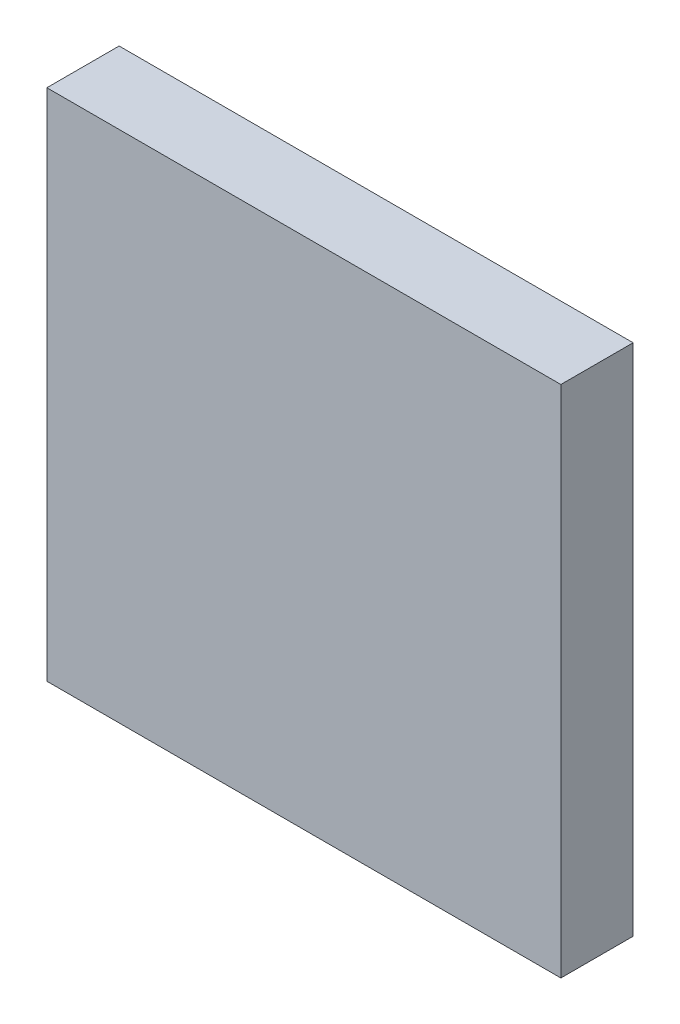
ISO-10303-21;
HEADER;
FILE_DESCRIPTION(('STEP AP214'),'2;1');
FILE_NAME('part.step','',(''),(''),'','','');
FILE_SCHEMA(('AUTOMOTIVE_DESIGN { 1 0 10303 214 1 1 1 1 }'));
ENDSEC;
DATA;
#1=APPLICATION_CONTEXT('core data for automotive mechanical design processes');
#2=APPLICATION_PROTOCOL_DEFINITION('international standard','automotive_design',2000,#1);
#3=PRODUCT_CONTEXT('',#1,'mechanical');
#4=PRODUCT('Part','Part','',(#3));
#5=PRODUCT_RELATED_PRODUCT_CATEGORY('part','',(#4));
#6=PRODUCT_DEFINITION_FORMATION('','',#4);
#7=PRODUCT_DEFINITION_CONTEXT('part definition',#1,'design');
#8=PRODUCT_DEFINITION('design','',#6,#7);
#9=PRODUCT_DEFINITION_SHAPE('','',#8);
#10=(LENGTH_UNIT() NAMED_UNIT(*) SI_UNIT(.MILLI.,.METRE.));
#11=(NAMED_UNIT(*) PLANE_ANGLE_UNIT() SI_UNIT($,.RADIAN.));
#12=(NAMED_UNIT(*) SI_UNIT($,.STERADIAN.) SOLID_ANGLE_UNIT());
#13=UNCERTAINTY_MEASURE_WITH_UNIT(LENGTH_MEASURE(1.E-05),#10,'distance_accuracy_value','');
#14=(GEOMETRIC_REPRESENTATION_CONTEXT(3) GLOBAL_UNCERTAINTY_ASSIGNED_CONTEXT((#13)) GLOBAL_UNIT_ASSIGNED_CONTEXT((#10,
#11,#12)) REPRESENTATION_CONTEXT('',''));
#15=CARTESIAN_POINT('',(0.,0.,0.));
#16=DIRECTION('',(0.,0.,1.));
#17=DIRECTION('',(1.,0.,0.));
#18=AXIS2_PLACEMENT_3D('',#15,#16,#17);
#19=CARTESIAN_POINT('',(-3.556,-3.556,1.));
#20=DIRECTION('',(1.,0.,0.));
#21=DIRECTION('',(0.,0.,-1.));
#22=AXIS2_PLACEMENT_3D('',#19,#20,#21);
#23=PLANE('',#22);
#24=DIRECTION('',(0.,-1.,0.));
#25=VECTOR('',#24,1.);
#26=CARTESIAN_POINT('',(-3.556,-3.556,0.));
#27=LINE('',#26,#25);
#28=CARTESIAN_POINT('',(-3.556,3.556,0.));
#29=VERTEX_POINT('',#28);
#30=CARTESIAN_POINT('',(-3.556,-3.556,0.));
#31=VERTEX_POINT('',#30);
#32=EDGE_CURVE('E95',#29,#31,#27,.T.);
#33=ORIENTED_EDGE('',*,*,#32,.T.);
#34=DIRECTION('',(0.,0.,-1.));
#35=VECTOR('',#34,1.);
#36=CARTESIAN_POINT('',(-3.556,-3.556,1.));
#37=LINE('',#36,#35);
#38=CARTESIAN_POINT('',(-3.556,-3.556,1.));
#39=VERTEX_POINT('',#38);
#40=EDGE_CURVE('E11',#39,#31,#37,.T.);
#41=ORIENTED_EDGE('',*,*,#40,.F.);
#42=DIRECTION('',(0.,-1.,0.));
#43=VECTOR('',#42,1.);
#44=CARTESIAN_POINT('',(-3.556,-3.556,1.));
#45=LINE('',#44,#43);
#46=CARTESIAN_POINT('',(-3.556,3.556,1.));
#47=VERTEX_POINT('',#46);
#48=EDGE_CURVE('E83',#47,#39,#45,.T.);
#49=ORIENTED_EDGE('',*,*,#48,.F.);
#50=DIRECTION('',(0.,0.,-1.));
#51=VECTOR('',#50,1.);
#52=CARTESIAN_POINT('',(-3.556,3.556,1.));
#53=LINE('',#52,#51);
#54=EDGE_CURVE('E91',#47,#29,#53,.T.);
#55=ORIENTED_EDGE('',*,*,#54,.T.);
#56=EDGE_LOOP('',(#33,#41,#49,#55));
#57=FACE_BOUND('',#56,.T.);
#58=ADVANCED_FACE('F32',(#57),#23,.F.);
#59=CARTESIAN_POINT('',(3.556,-3.556,1.));
#60=DIRECTION('',(0.,1.,0.));
#61=DIRECTION('',(0.,0.,1.));
#62=AXIS2_PLACEMENT_3D('',#59,#60,#61);
#63=PLANE('',#62);
#64=DIRECTION('',(1.,0.,0.));
#65=VECTOR('',#64,1.);
#66=CARTESIAN_POINT('',(3.556,-3.556,0.));
#67=LINE('',#66,#65);
#68=CARTESIAN_POINT('',(3.556,-3.556,0.));
#69=VERTEX_POINT('',#68);
#70=EDGE_CURVE('E87',#31,#69,#67,.T.);
#71=ORIENTED_EDGE('',*,*,#70,.T.);
#72=DIRECTION('',(0.,0.,-1.));
#73=VECTOR('',#72,1.);
#74=CARTESIAN_POINT('',(3.556,-3.556,1.));
#75=LINE('',#74,#73);
#76=CARTESIAN_POINT('',(3.556,-3.556,1.));
#77=VERTEX_POINT('',#76);
#78=EDGE_CURVE('E40',#77,#69,#75,.T.);
#79=ORIENTED_EDGE('',*,*,#78,.F.);
#80=DIRECTION('',(1.,0.,0.));
#81=VECTOR('',#80,1.);
#82=CARTESIAN_POINT('',(3.556,-3.556,1.));
#83=LINE('',#82,#81);
#84=EDGE_CURVE('E78',#39,#77,#83,.T.);
#85=ORIENTED_EDGE('',*,*,#84,.F.);
#86=ORIENTED_EDGE('',*,*,#40,.T.);
#87=EDGE_LOOP('',(#71,#79,#85,#86));
#88=FACE_BOUND('',#87,.T.);
#89=ADVANCED_FACE('F86',(#88),#63,.F.);
#90=CARTESIAN_POINT('',(3.556,3.556,1.));
#91=DIRECTION('',(-1.,0.,0.));
#92=DIRECTION('',(0.,0.,1.));
#93=AXIS2_PLACEMENT_3D('',#90,#91,#92);
#94=PLANE('',#93);
#95=DIRECTION('',(0.,1.,0.));
#96=VECTOR('',#95,1.);
#97=CARTESIAN_POINT('',(3.556,3.556,0.));
#98=LINE('',#97,#96);
#99=CARTESIAN_POINT('',(3.556,3.556,0.));
#100=VERTEX_POINT('',#99);
#101=EDGE_CURVE('E65',#69,#100,#98,.T.);
#102=ORIENTED_EDGE('',*,*,#101,.T.);
#103=DIRECTION('',(0.,0.,-1.));
#104=VECTOR('',#103,1.);
#105=CARTESIAN_POINT('',(3.556,3.556,1.));
#106=LINE('',#105,#104);
#107=CARTESIAN_POINT('',(3.556,3.556,1.));
#108=VERTEX_POINT('',#107);
#109=EDGE_CURVE('E88',#108,#100,#106,.T.);
#110=ORIENTED_EDGE('',*,*,#109,.F.);
#111=DIRECTION('',(0.,1.,0.));
#112=VECTOR('',#111,1.);
#113=CARTESIAN_POINT('',(3.556,3.556,1.));
#114=LINE('',#113,#112);
#115=EDGE_CURVE('E81',#77,#108,#114,.T.);
#116=ORIENTED_EDGE('',*,*,#115,.F.);
#117=ORIENTED_EDGE('',*,*,#78,.T.);
#118=EDGE_LOOP('',(#102,#110,#116,#117));
#119=FACE_BOUND('',#118,.T.);
#120=ADVANCED_FACE('F89',(#119),#94,.F.);
#121=CARTESIAN_POINT('',(-3.556,3.556,1.));
#122=DIRECTION('',(0.,-1.,0.));
#123=DIRECTION('',(0.,0.,-1.));
#124=AXIS2_PLACEMENT_3D('',#121,#122,#123);
#125=PLANE('',#124);
#126=DIRECTION('',(-1.,0.,0.));
#127=VECTOR('',#126,1.);
#128=CARTESIAN_POINT('',(-3.556,3.556,0.));
#129=LINE('',#128,#127);
#130=EDGE_CURVE('E71',#100,#29,#129,.T.);
#131=ORIENTED_EDGE('',*,*,#130,.T.);
#132=ORIENTED_EDGE('',*,*,#54,.F.);
#133=DIRECTION('',(-1.,0.,0.));
#134=VECTOR('',#133,1.);
#135=CARTESIAN_POINT('',(-3.556,3.556,1.));
#136=LINE('',#135,#134);
#137=EDGE_CURVE('E48',#108,#47,#136,.T.);
#138=ORIENTED_EDGE('',*,*,#137,.F.);
#139=ORIENTED_EDGE('',*,*,#109,.T.);
#140=EDGE_LOOP('',(#131,#132,#138,#139));
#141=FACE_BOUND('',#140,.T.);
#142=ADVANCED_FACE('F102',(#141),#125,.F.);
#143=CARTESIAN_POINT('',(0.,0.,1.));
#144=DIRECTION('',(0.,0.,-1.));
#145=DIRECTION('',(-1.,0.,0.));
#146=AXIS2_PLACEMENT_3D('',#143,#144,#145);
#147=PLANE('',#146);
#148=ORIENTED_EDGE('',*,*,#48,.T.);
#149=ORIENTED_EDGE('',*,*,#84,.T.);
#150=ORIENTED_EDGE('',*,*,#115,.T.);
#151=ORIENTED_EDGE('',*,*,#137,.T.);
#152=EDGE_LOOP('',(#148,#149,#150,#151));
#153=FACE_BOUND('',#152,.T.);
#154=ADVANCED_FACE('F79',(#153),#147,.F.);
#155=CARTESIAN_POINT('',(0.,0.,0.));
#156=DIRECTION('',(0.,0.,-1.));
#157=DIRECTION('',(-1.,0.,0.));
#158=AXIS2_PLACEMENT_3D('',#155,#156,#157);
#159=PLANE('',#158);
#160=ORIENTED_EDGE('',*,*,#32,.F.);
#161=ORIENTED_EDGE('',*,*,#130,.F.);
#162=ORIENTED_EDGE('',*,*,#101,.F.);
#163=ORIENTED_EDGE('',*,*,#70,.F.);
#164=EDGE_LOOP('',(#160,#161,#162,#163));
#165=FACE_BOUND('',#164,.T.);
#166=ADVANCED_FACE('F105',(#165),#159,.T.);
#167=CLOSED_SHELL('',(#58,#89,#120,#142,#154,#166));
#168=MANIFOLD_SOLID_BREP('B2',#167);
#169=ADVANCED_BREP_SHAPE_REPRESENTATION('',(#18,#168),#14);
#170=SHAPE_DEFINITION_REPRESENTATION(#9,#169);
ENDSEC;
END-ISO-10303-21;
